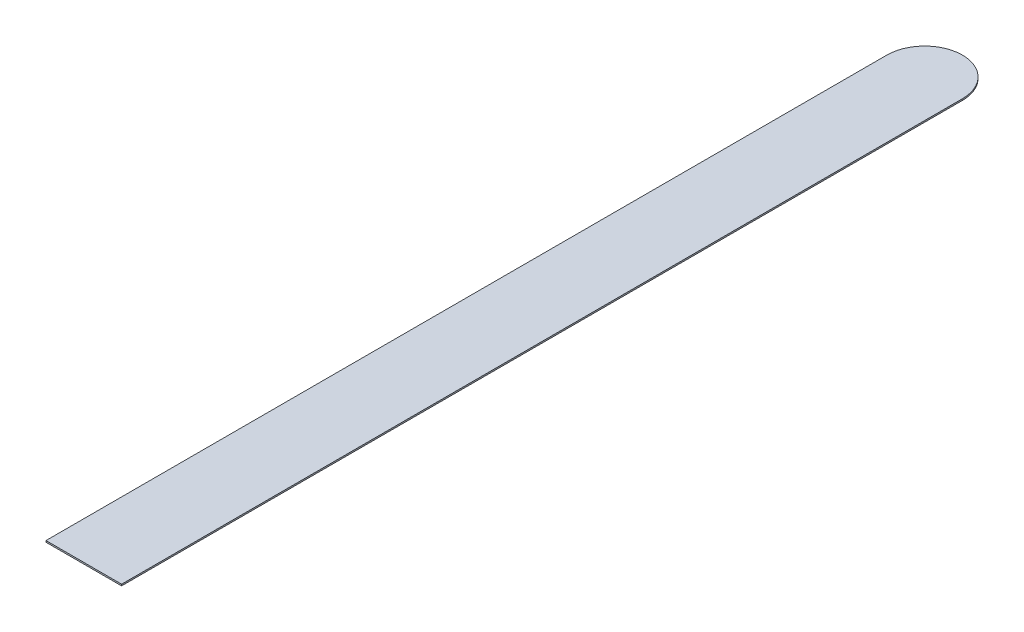
ISO-10303-21;
HEADER;
FILE_DESCRIPTION(('STEP AP214'),'2;1');
FILE_NAME('part.step','',(''),(''),'','','');
FILE_SCHEMA(('AUTOMOTIVE_DESIGN { 1 0 10303 214 1 1 1 1 }'));
ENDSEC;
DATA;
#1=APPLICATION_CONTEXT('core data for automotive mechanical design processes');
#2=APPLICATION_PROTOCOL_DEFINITION('international standard','automotive_design',2000,#1);
#3=PRODUCT_CONTEXT('',#1,'mechanical');
#4=PRODUCT('Part','Part','',(#3));
#5=PRODUCT_RELATED_PRODUCT_CATEGORY('part','',(#4));
#6=PRODUCT_DEFINITION_FORMATION('','',#4);
#7=PRODUCT_DEFINITION_CONTEXT('part definition',#1,'design');
#8=PRODUCT_DEFINITION('design','',#6,#7);
#9=PRODUCT_DEFINITION_SHAPE('','',#8);
#10=(LENGTH_UNIT() NAMED_UNIT(*) SI_UNIT(.MILLI.,.METRE.));
#11=(NAMED_UNIT(*) PLANE_ANGLE_UNIT() SI_UNIT($,.RADIAN.));
#12=(NAMED_UNIT(*) SI_UNIT($,.STERADIAN.) SOLID_ANGLE_UNIT());
#13=UNCERTAINTY_MEASURE_WITH_UNIT(LENGTH_MEASURE(1.E-05),#10,'distance_accuracy_value','');
#14=(GEOMETRIC_REPRESENTATION_CONTEXT(3) GLOBAL_UNCERTAINTY_ASSIGNED_CONTEXT((#13)) GLOBAL_UNIT_ASSIGNED_CONTEXT((#10,
#11,#12)) REPRESENTATION_CONTEXT('',''));
#15=CARTESIAN_POINT('',(0.,0.,0.));
#16=DIRECTION('',(0.,0.,1.));
#17=DIRECTION('',(1.,0.,0.));
#18=AXIS2_PLACEMENT_3D('',#15,#16,#17);
#19=CARTESIAN_POINT('',(0.,0.127,0.));
#20=DIRECTION('',(1.,0.,0.));
#21=DIRECTION('',(0.,0.,-1.));
#22=AXIS2_PLACEMENT_3D('',#19,#20,#21);
#23=PLANE('',#22);
#24=DIRECTION('',(0.,0.,1.));
#25=VECTOR('',#24,1.);
#26=CARTESIAN_POINT('',(0.,0.,0.));
#27=LINE('',#26,#25);
#28=CARTESIAN_POINT('',(0.,0.,-70.6374));
#29=VERTEX_POINT('',#28);
#30=CARTESIAN_POINT('',(0.,0.,0.));
#31=VERTEX_POINT('',#30);
#32=EDGE_CURVE('E95',#29,#31,#27,.T.);
#33=ORIENTED_EDGE('',*,*,#32,.T.);
#34=DIRECTION('',(0.,-1.,0.));
#35=VECTOR('',#34,1.);
#36=CARTESIAN_POINT('',(0.,0.127,0.));
#37=LINE('',#36,#35);
#38=CARTESIAN_POINT('',(0.,0.127,0.));
#39=VERTEX_POINT('',#38);
#40=EDGE_CURVE('E11',#39,#31,#37,.T.);
#41=ORIENTED_EDGE('',*,*,#40,.F.);
#42=DIRECTION('',(0.,0.,1.));
#43=VECTOR('',#42,1.);
#44=CARTESIAN_POINT('',(0.,0.127,0.));
#45=LINE('',#44,#43);
#46=CARTESIAN_POINT('',(0.,0.127,-70.6374));
#47=VERTEX_POINT('',#46);
#48=EDGE_CURVE('E83',#47,#39,#45,.T.);
#49=ORIENTED_EDGE('',*,*,#48,.F.);
#50=DIRECTION('',(0.,-1.,0.));
#51=VECTOR('',#50,1.);
#52=CARTESIAN_POINT('',(0.,0.127,-70.6374));
#53=LINE('',#52,#51);
#54=EDGE_CURVE('E91',#47,#29,#53,.T.);
#55=ORIENTED_EDGE('',*,*,#54,.T.);
#56=EDGE_LOOP('',(#33,#41,#49,#55));
#57=FACE_BOUND('',#56,.T.);
#58=ADVANCED_FACE('F32',(#57),#23,.F.);
#59=CARTESIAN_POINT('',(0.,0.127,0.));
#60=DIRECTION('',(0.,0.,-1.));
#61=DIRECTION('',(-1.,0.,0.));
#62=AXIS2_PLACEMENT_3D('',#59,#60,#61);
#63=PLANE('',#62);
#64=DIRECTION('',(1.,0.,0.));
#65=VECTOR('',#64,1.);
#66=CARTESIAN_POINT('',(0.,0.,0.));
#67=LINE('',#66,#65);
#68=CARTESIAN_POINT('',(6.35,0.,0.));
#69=VERTEX_POINT('',#68);
#70=EDGE_CURVE('E87',#31,#69,#67,.T.);
#71=ORIENTED_EDGE('',*,*,#70,.T.);
#72=DIRECTION('',(0.,-1.,0.));
#73=VECTOR('',#72,1.);
#74=CARTESIAN_POINT('',(6.35,0.127,0.));
#75=LINE('',#74,#73);
#76=CARTESIAN_POINT('',(6.35,0.127,0.));
#77=VERTEX_POINT('',#76);
#78=EDGE_CURVE('E40',#77,#69,#75,.T.);
#79=ORIENTED_EDGE('',*,*,#78,.F.);
#80=DIRECTION('',(1.,0.,0.));
#81=VECTOR('',#80,1.);
#82=CARTESIAN_POINT('',(0.,0.127,0.));
#83=LINE('',#82,#81);
#84=EDGE_CURVE('E78',#39,#77,#83,.T.);
#85=ORIENTED_EDGE('',*,*,#84,.F.);
#86=ORIENTED_EDGE('',*,*,#40,.T.);
#87=EDGE_LOOP('',(#71,#79,#85,#86));
#88=FACE_BOUND('',#87,.T.);
#89=ADVANCED_FACE('F86',(#88),#63,.F.);
#90=CARTESIAN_POINT('',(6.35,0.127,0.));
#91=DIRECTION('',(-1.,0.,0.));
#92=DIRECTION('',(0.,0.,1.));
#93=AXIS2_PLACEMENT_3D('',#90,#91,#92);
#94=PLANE('',#93);
#95=DIRECTION('',(0.,0.,-1.));
#96=VECTOR('',#95,1.);
#97=CARTESIAN_POINT('',(6.35,0.,0.));
#98=LINE('',#97,#96);
#99=CARTESIAN_POINT('',(6.35,0.,-70.6374));
#100=VERTEX_POINT('',#99);
#101=EDGE_CURVE('E65',#69,#100,#98,.T.);
#102=ORIENTED_EDGE('',*,*,#101,.T.);
#103=DIRECTION('',(0.,-1.,0.));
#104=VECTOR('',#103,1.);
#105=CARTESIAN_POINT('',(6.35,0.127,-70.6374));
#106=LINE('',#105,#104);
#107=CARTESIAN_POINT('',(6.35,0.127,-70.6374));
#108=VERTEX_POINT('',#107);
#109=EDGE_CURVE('E88',#108,#100,#106,.T.);
#110=ORIENTED_EDGE('',*,*,#109,.F.);
#111=DIRECTION('',(0.,0.,-1.));
#112=VECTOR('',#111,1.);
#113=CARTESIAN_POINT('',(6.35,0.127,0.));
#114=LINE('',#113,#112);
#115=EDGE_CURVE('E81',#77,#108,#114,.T.);
#116=ORIENTED_EDGE('',*,*,#115,.F.);
#117=ORIENTED_EDGE('',*,*,#78,.T.);
#118=EDGE_LOOP('',(#102,#110,#116,#117));
#119=FACE_BOUND('',#118,.T.);
#120=ADVANCED_FACE('F89',(#119),#94,.F.);
#121=CARTESIAN_POINT('',(3.17499999999999,0.127,-70.6374));
#122=DIRECTION('',(0.,-1.,0.));
#123=DIRECTION('',(0.,0.,-1.));
#124=AXIS2_PLACEMENT_3D('',#121,#122,#123);
#125=CYLINDRICAL_SURFACE('',#124,3.175);
#126=CARTESIAN_POINT('',(3.17499999999999,0.,-70.6374));
#127=DIRECTION('',(0.,1.,0.));
#128=DIRECTION('',(0.,0.,1.));
#129=AXIS2_PLACEMENT_3D('',#126,#127,#128);
#130=CIRCLE('',#129,3.175);
#131=EDGE_CURVE('E71',#100,#29,#130,.T.);
#132=ORIENTED_EDGE('',*,*,#131,.T.);
#133=ORIENTED_EDGE('',*,*,#54,.F.);
#134=CARTESIAN_POINT('',(3.17499999999999,0.127,-70.6374));
#135=DIRECTION('',(0.,1.,0.));
#136=DIRECTION('',(0.,0.,1.));
#137=AXIS2_PLACEMENT_3D('',#134,#135,#136);
#138=CIRCLE('',#137,3.175);
#139=EDGE_CURVE('E48',#108,#47,#138,.T.);
#140=ORIENTED_EDGE('',*,*,#139,.F.);
#141=ORIENTED_EDGE('',*,*,#109,.T.);
#142=EDGE_LOOP('',(#132,#133,#140,#141));
#143=FACE_BOUND('',#142,.T.);
#144=ADVANCED_FACE('F102',(#143),#125,.T.);
#145=CARTESIAN_POINT('',(3.17499999999999,0.127,-70.6374));
#146=DIRECTION('',(0.,1.,0.));
#147=DIRECTION('',(0.,0.,1.));
#148=AXIS2_PLACEMENT_3D('',#145,#146,#147);
#149=PLANE('',#148);
#150=ORIENTED_EDGE('',*,*,#48,.T.);
#151=ORIENTED_EDGE('',*,*,#84,.T.);
#152=ORIENTED_EDGE('',*,*,#115,.T.);
#153=ORIENTED_EDGE('',*,*,#139,.T.);
#154=EDGE_LOOP('',(#150,#151,#152,#153));
#155=FACE_BOUND('',#154,.T.);
#156=ADVANCED_FACE('F79',(#155),#149,.T.);
#157=CARTESIAN_POINT('',(3.17499999999999,0.,-70.6374));
#158=DIRECTION('',(0.,1.,0.));
#159=DIRECTION('',(0.,0.,1.));
#160=AXIS2_PLACEMENT_3D('',#157,#158,#159);
#161=PLANE('',#160);
#162=ORIENTED_EDGE('',*,*,#32,.F.);
#163=ORIENTED_EDGE('',*,*,#131,.F.);
#164=ORIENTED_EDGE('',*,*,#101,.F.);
#165=ORIENTED_EDGE('',*,*,#70,.F.);
#166=EDGE_LOOP('',(#162,#163,#164,#165));
#167=FACE_BOUND('',#166,.T.);
#168=ADVANCED_FACE('F105',(#167),#161,.F.);
#169=CLOSED_SHELL('',(#58,#89,#120,#144,#156,#168));
#170=MANIFOLD_SOLID_BREP('B2',#169);
#171=ADVANCED_BREP_SHAPE_REPRESENTATION('',(#18,#170),#14);
#172=SHAPE_DEFINITION_REPRESENTATION(#9,#171);
ENDSEC;
END-ISO-10303-21;
